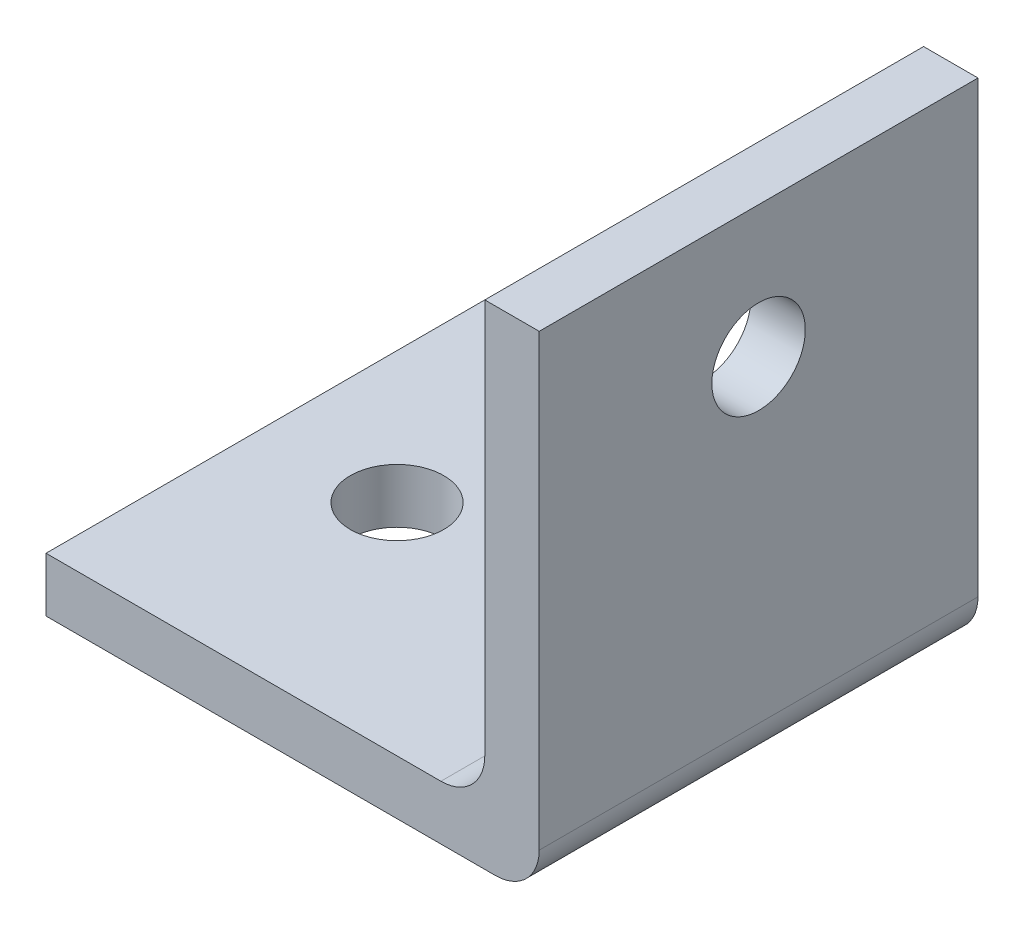
ISO-10303-21;
HEADER;
FILE_DESCRIPTION(('STEP AP214'),'2;1');
FILE_NAME('part.step','',(''),(''),'','','');
FILE_SCHEMA(('AUTOMOTIVE_DESIGN { 1 0 10303 214 1 1 1 1 }'));
ENDSEC;
DATA;
#1=APPLICATION_CONTEXT('core data for automotive mechanical design processes');
#2=APPLICATION_PROTOCOL_DEFINITION('international standard','automotive_design',2000,#1);
#3=PRODUCT_CONTEXT('',#1,'mechanical');
#4=PRODUCT('Part','Part','',(#3));
#5=PRODUCT_RELATED_PRODUCT_CATEGORY('part','',(#4));
#6=PRODUCT_DEFINITION_FORMATION('','',#4);
#7=PRODUCT_DEFINITION_CONTEXT('part definition',#1,'design');
#8=PRODUCT_DEFINITION('design','',#6,#7);
#9=PRODUCT_DEFINITION_SHAPE('','',#8);
#10=(LENGTH_UNIT() NAMED_UNIT(*) SI_UNIT(.MILLI.,.METRE.));
#11=(NAMED_UNIT(*) PLANE_ANGLE_UNIT() SI_UNIT($,.RADIAN.));
#12=(NAMED_UNIT(*) SI_UNIT($,.STERADIAN.) SOLID_ANGLE_UNIT());
#13=UNCERTAINTY_MEASURE_WITH_UNIT(LENGTH_MEASURE(1.E-05),#10,'distance_accuracy_value','');
#14=(GEOMETRIC_REPRESENTATION_CONTEXT(3) GLOBAL_UNCERTAINTY_ASSIGNED_CONTEXT((#13)) GLOBAL_UNIT_ASSIGNED_CONTEXT((#10,
#11,#12)) REPRESENTATION_CONTEXT('',''));
#15=CARTESIAN_POINT('',(0.,0.,0.));
#16=DIRECTION('',(0.,0.,1.));
#17=DIRECTION('',(1.,0.,0.));
#18=AXIS2_PLACEMENT_3D('',#15,#16,#17);
#19=CARTESIAN_POINT('',(0.,0.,12.7));
#20=DIRECTION('',(1.,0.,0.));
#21=DIRECTION('',(0.,0.,-1.));
#22=AXIS2_PLACEMENT_3D('',#19,#20,#21);
#23=PLANE('',#22);
#24=DIRECTION('',(0.,-1.,0.));
#25=VECTOR('',#24,1.);
#26=CARTESIAN_POINT('',(0.,0.,0.));
#27=LINE('',#26,#25);
#28=CARTESIAN_POINT('',(0.,1.5748,0.));
#29=VERTEX_POINT('',#28);
#30=CARTESIAN_POINT('',(0.,0.,0.));
#31=VERTEX_POINT('',#30);
#32=EDGE_CURVE('E117',#29,#31,#27,.T.);
#33=ORIENTED_EDGE('',*,*,#32,.T.);
#34=DIRECTION('',(0.,0.,-1.));
#35=VECTOR('',#34,1.);
#36=CARTESIAN_POINT('',(0.,0.,12.7));
#37=LINE('',#36,#35);
#38=CARTESIAN_POINT('',(0.,0.,12.7));
#39=VERTEX_POINT('',#38);
#40=EDGE_CURVE('E100',#39,#31,#37,.T.);
#41=ORIENTED_EDGE('',*,*,#40,.F.);
#42=DIRECTION('',(0.,-1.,0.));
#43=VECTOR('',#42,1.);
#44=CARTESIAN_POINT('',(0.,0.,12.7));
#45=LINE('',#44,#43);
#46=CARTESIAN_POINT('',(0.,1.5748,12.7));
#47=VERTEX_POINT('',#46);
#48=EDGE_CURVE('E105',#47,#39,#45,.T.);
#49=ORIENTED_EDGE('',*,*,#48,.F.);
#50=DIRECTION('',(0.,0.,-1.));
#51=VECTOR('',#50,1.);
#52=CARTESIAN_POINT('',(0.,1.5748,12.7));
#53=LINE('',#52,#51);
#54=EDGE_CURVE('E158',#47,#29,#53,.T.);
#55=ORIENTED_EDGE('',*,*,#54,.T.);
#56=EDGE_LOOP('',(#33,#41,#49,#55));
#57=FACE_BOUND('',#56,.T.);
#58=ADVANCED_FACE('F34',(#57),#23,.F.);
#59=CARTESIAN_POINT('',(0.,0.,12.7));
#60=DIRECTION('',(0.,1.,0.));
#61=DIRECTION('',(0.,0.,1.));
#62=AXIS2_PLACEMENT_3D('',#59,#60,#61);
#63=PLANE('',#62);
#64=CARTESIAN_POINT('',(3.81,0.,6.35));
#65=DIRECTION('',(0.,1.,0.));
#66=DIRECTION('',(0.,0.,1.));
#67=AXIS2_PLACEMENT_3D('',#64,#65,#66);
#68=CIRCLE('',#67,1.35255);
#69=CARTESIAN_POINT('',(3.81,0.,7.70255));
#70=VERTEX_POINT('',#69);
#71=EDGE_CURVE('E186',#70,#70,#68,.T.);
#72=ORIENTED_EDGE('',*,*,#71,.T.);
#73=EDGE_LOOP('',(#72));
#74=FACE_BOUND('',#73,.T.);
#75=DIRECTION('',(1.,0.,0.));
#76=VECTOR('',#75,1.);
#77=CARTESIAN_POINT('',(0.,0.,0.));
#78=LINE('',#77,#76);
#79=CARTESIAN_POINT('',(13.0048,0.,0.));
#80=VERTEX_POINT('',#79);
#81=EDGE_CURVE('E166',#31,#80,#78,.T.);
#82=ORIENTED_EDGE('',*,*,#81,.T.);
#83=DIRECTION('',(0.,0.,-1.));
#84=VECTOR('',#83,1.);
#85=CARTESIAN_POINT('',(13.0048,0.,12.7));
#86=LINE('',#85,#84);
#87=CARTESIAN_POINT('',(13.0048,0.,12.7));
#88=VERTEX_POINT('',#87);
#89=EDGE_CURVE('E49',#80,#88,#86,.F.);
#90=ORIENTED_EDGE('',*,*,#89,.T.);
#91=DIRECTION('',(1.,0.,0.));
#92=VECTOR('',#91,1.);
#93=CARTESIAN_POINT('',(0.,0.,12.7));
#94=LINE('',#93,#92);
#95=EDGE_CURVE('E96',#39,#88,#94,.T.);
#96=ORIENTED_EDGE('',*,*,#95,.F.);
#97=ORIENTED_EDGE('',*,*,#40,.T.);
#98=EDGE_LOOP('',(#82,#90,#96,#97));
#99=FACE_BOUND('',#98,.T.);
#100=ADVANCED_FACE('F98',(#74,#99),#63,.F.);
#101=CARTESIAN_POINT('',(14.2748,0.,12.7));
#102=DIRECTION('',(-1.,0.,0.));
#103=DIRECTION('',(0.,0.,1.));
#104=AXIS2_PLACEMENT_3D('',#101,#102,#103);
#105=PLANE('',#104);
#106=CARTESIAN_POINT('',(14.2748,10.4648,6.35));
#107=DIRECTION('',(-1.,0.,0.));
#108=DIRECTION('',(0.,0.,1.));
#109=AXIS2_PLACEMENT_3D('',#106,#107,#108);
#110=CIRCLE('',#109,1.35255);
#111=CARTESIAN_POINT('',(14.2748,10.4648,7.70255));
#112=VERTEX_POINT('',#111);
#113=EDGE_CURVE('E167',#112,#112,#110,.T.);
#114=ORIENTED_EDGE('',*,*,#113,.T.);
#115=EDGE_LOOP('',(#114));
#116=FACE_BOUND('',#115,.T.);
#117=DIRECTION('',(0.,1.,0.));
#118=VECTOR('',#117,1.);
#119=CARTESIAN_POINT('',(14.2748,0.,12.7));
#120=LINE('',#119,#118);
#121=CARTESIAN_POINT('',(14.2748,1.27,12.7));
#122=VERTEX_POINT('',#121);
#123=CARTESIAN_POINT('',(14.2748,14.2748,12.7));
#124=VERTEX_POINT('',#123);
#125=EDGE_CURVE('E104',#122,#124,#120,.T.);
#126=ORIENTED_EDGE('',*,*,#125,.F.);
#127=DIRECTION('',(0.,0.,-1.));
#128=VECTOR('',#127,1.);
#129=CARTESIAN_POINT('',(14.2748,1.27,12.7));
#130=LINE('',#129,#128);
#131=CARTESIAN_POINT('',(14.2748,1.27,0.));
#132=VERTEX_POINT('',#131);
#133=EDGE_CURVE('E130',#122,#132,#130,.T.);
#134=ORIENTED_EDGE('',*,*,#133,.T.);
#135=DIRECTION('',(0.,1.,0.));
#136=VECTOR('',#135,1.);
#137=CARTESIAN_POINT('',(14.2748,0.,0.));
#138=LINE('',#137,#136);
#139=CARTESIAN_POINT('',(14.2748,14.2748,0.));
#140=VERTEX_POINT('',#139);
#141=EDGE_CURVE('E169',#132,#140,#138,.T.);
#142=ORIENTED_EDGE('',*,*,#141,.T.);
#143=DIRECTION('',(0.,0.,-1.));
#144=VECTOR('',#143,1.);
#145=CARTESIAN_POINT('',(14.2748,14.2748,12.7));
#146=LINE('',#145,#144);
#147=EDGE_CURVE('E119',#124,#140,#146,.T.);
#148=ORIENTED_EDGE('',*,*,#147,.F.);
#149=EDGE_LOOP('',(#126,#134,#142,#148));
#150=FACE_BOUND('',#149,.T.);
#151=ADVANCED_FACE('F177',(#116,#150),#105,.F.);
#152=CARTESIAN_POINT('',(12.7,14.2748,12.7));
#153=DIRECTION('',(0.,-1.,0.));
#154=DIRECTION('',(0.,0.,-1.));
#155=AXIS2_PLACEMENT_3D('',#152,#153,#154);
#156=PLANE('',#155);
#157=DIRECTION('',(-1.,0.,0.));
#158=VECTOR('',#157,1.);
#159=CARTESIAN_POINT('',(12.7,14.2748,0.));
#160=LINE('',#159,#158);
#161=CARTESIAN_POINT('',(12.7,14.2748,0.));
#162=VERTEX_POINT('',#161);
#163=EDGE_CURVE('E151',#140,#162,#160,.T.);
#164=ORIENTED_EDGE('',*,*,#163,.T.);
#165=DIRECTION('',(0.,0.,-1.));
#166=VECTOR('',#165,1.);
#167=CARTESIAN_POINT('',(12.7,14.2748,12.7));
#168=LINE('',#167,#166);
#169=CARTESIAN_POINT('',(12.7,14.2748,12.7));
#170=VERTEX_POINT('',#169);
#171=EDGE_CURVE('E125',#170,#162,#168,.T.);
#172=ORIENTED_EDGE('',*,*,#171,.F.);
#173=DIRECTION('',(-1.,0.,0.));
#174=VECTOR('',#173,1.);
#175=CARTESIAN_POINT('',(12.7,14.2748,12.7));
#176=LINE('',#175,#174);
#177=EDGE_CURVE('E161',#124,#170,#176,.T.);
#178=ORIENTED_EDGE('',*,*,#177,.F.);
#179=ORIENTED_EDGE('',*,*,#147,.T.);
#180=EDGE_LOOP('',(#164,#172,#178,#179));
#181=FACE_BOUND('',#180,.T.);
#182=ADVANCED_FACE('F202',(#181),#156,.F.);
#183=CARTESIAN_POINT('',(12.7,1.5748,12.7));
#184=DIRECTION('',(1.,0.,0.));
#185=DIRECTION('',(0.,0.,-1.));
#186=AXIS2_PLACEMENT_3D('',#183,#184,#185);
#187=PLANE('',#186);
#188=CARTESIAN_POINT('',(12.7,10.4648,6.35));
#189=DIRECTION('',(-1.,0.,0.));
#190=DIRECTION('',(0.,0.,1.));
#191=AXIS2_PLACEMENT_3D('',#188,#189,#190);
#192=CIRCLE('',#191,1.35254999999999);
#193=CARTESIAN_POINT('',(12.7,10.4648,7.70254999999999));
#194=VERTEX_POINT('',#193);
#195=EDGE_CURVE('E183',#194,#194,#192,.T.);
#196=ORIENTED_EDGE('',*,*,#195,.F.);
#197=EDGE_LOOP('',(#196));
#198=FACE_BOUND('',#197,.T.);
#199=DIRECTION('',(0.,-1.,0.));
#200=VECTOR('',#199,1.);
#201=CARTESIAN_POINT('',(12.7,1.5748,0.));
#202=LINE('',#201,#200);
#203=CARTESIAN_POINT('',(12.7,2.8448,0.));
#204=VERTEX_POINT('',#203);
#205=EDGE_CURVE('E141',#162,#204,#202,.T.);
#206=ORIENTED_EDGE('',*,*,#205,.T.);
#207=DIRECTION('',(0.,0.,-1.));
#208=VECTOR('',#207,1.);
#209=CARTESIAN_POINT('',(12.7,2.8448,12.7));
#210=LINE('',#209,#208);
#211=CARTESIAN_POINT('',(12.7,2.8448,12.7));
#212=VERTEX_POINT('',#211);
#213=EDGE_CURVE('E122',#204,#212,#210,.F.);
#214=ORIENTED_EDGE('',*,*,#213,.T.);
#215=DIRECTION('',(0.,-1.,0.));
#216=VECTOR('',#215,1.);
#217=CARTESIAN_POINT('',(12.7,1.5748,12.7));
#218=LINE('',#217,#216);
#219=EDGE_CURVE('E155',#170,#212,#218,.T.);
#220=ORIENTED_EDGE('',*,*,#219,.F.);
#221=ORIENTED_EDGE('',*,*,#171,.T.);
#222=EDGE_LOOP('',(#206,#214,#220,#221));
#223=FACE_BOUND('',#222,.T.);
#224=ADVANCED_FACE('F147',(#198,#223),#187,.F.);
#225=CARTESIAN_POINT('',(0.,1.5748,12.7));
#226=DIRECTION('',(0.,-1.,0.));
#227=DIRECTION('',(0.,0.,-1.));
#228=AXIS2_PLACEMENT_3D('',#225,#226,#227);
#229=PLANE('',#228);
#230=CARTESIAN_POINT('',(3.81,1.5748,6.35));
#231=DIRECTION('',(0.,1.,0.));
#232=DIRECTION('',(0.,0.,1.));
#233=AXIS2_PLACEMENT_3D('',#230,#231,#232);
#234=CIRCLE('',#233,1.35254999999999);
#235=CARTESIAN_POINT('',(3.81,1.5748,7.70254999999999));
#236=VERTEX_POINT('',#235);
#237=EDGE_CURVE('E189',#236,#236,#234,.T.);
#238=ORIENTED_EDGE('',*,*,#237,.F.);
#239=EDGE_LOOP('',(#238));
#240=FACE_BOUND('',#239,.T.);
#241=DIRECTION('',(-1.,0.,0.));
#242=VECTOR('',#241,1.);
#243=CARTESIAN_POINT('',(0.,1.5748,12.7));
#244=LINE('',#243,#242);
#245=CARTESIAN_POINT('',(11.43,1.5748,12.7));
#246=VERTEX_POINT('',#245);
#247=EDGE_CURVE('E110',#246,#47,#244,.T.);
#248=ORIENTED_EDGE('',*,*,#247,.F.);
#249=DIRECTION('',(0.,0.,-1.));
#250=VECTOR('',#249,1.);
#251=CARTESIAN_POINT('',(11.43,1.5748,0.));
#252=LINE('',#251,#250);
#253=CARTESIAN_POINT('',(11.43,1.5748,0.));
#254=VERTEX_POINT('',#253);
#255=EDGE_CURVE('E118',#246,#254,#252,.T.);
#256=ORIENTED_EDGE('',*,*,#255,.T.);
#257=DIRECTION('',(-1.,0.,0.));
#258=VECTOR('',#257,1.);
#259=CARTESIAN_POINT('',(0.,1.5748,0.));
#260=LINE('',#259,#258);
#261=EDGE_CURVE('E114',#254,#29,#260,.T.);
#262=ORIENTED_EDGE('',*,*,#261,.T.);
#263=ORIENTED_EDGE('',*,*,#54,.F.);
#264=EDGE_LOOP('',(#248,#256,#262,#263));
#265=FACE_BOUND('',#264,.T.);
#266=ADVANCED_FACE('F157',(#240,#265),#229,.F.);
#267=CARTESIAN_POINT('',(0.,0.,12.7));
#268=DIRECTION('',(0.,0.,-1.));
#269=DIRECTION('',(-1.,0.,0.));
#270=AXIS2_PLACEMENT_3D('',#267,#268,#269);
#271=PLANE('',#270);
#272=ORIENTED_EDGE('',*,*,#95,.T.);
#273=CARTESIAN_POINT('',(13.0048,1.27,12.7));
#274=DIRECTION('',(0.,0.,-1.));
#275=DIRECTION('',(-1.,0.,0.));
#276=AXIS2_PLACEMENT_3D('',#273,#274,#275);
#277=CIRCLE('',#276,1.27);
#278=EDGE_CURVE('E135',#88,#122,#277,.F.);
#279=ORIENTED_EDGE('',*,*,#278,.T.);
#280=ORIENTED_EDGE('',*,*,#125,.T.);
#281=ORIENTED_EDGE('',*,*,#177,.T.);
#282=ORIENTED_EDGE('',*,*,#219,.T.);
#283=CARTESIAN_POINT('',(11.43,2.8448,12.7));
#284=DIRECTION('',(0.,0.,-1.));
#285=DIRECTION('',(-1.,0.,0.));
#286=AXIS2_PLACEMENT_3D('',#283,#284,#285);
#287=CIRCLE('',#286,1.27);
#288=EDGE_CURVE('E11',#212,#246,#287,.T.);
#289=ORIENTED_EDGE('',*,*,#288,.T.);
#290=ORIENTED_EDGE('',*,*,#247,.T.);
#291=ORIENTED_EDGE('',*,*,#48,.T.);
#292=EDGE_LOOP('',(#272,#279,#280,#281,#282,#289,#290,#291));
#293=FACE_BOUND('',#292,.T.);
#294=ADVANCED_FACE('F108',(#293),#271,.F.);
#295=CARTESIAN_POINT('',(0.,0.,0.));
#296=DIRECTION('',(0.,0.,-1.));
#297=DIRECTION('',(-1.,0.,0.));
#298=AXIS2_PLACEMENT_3D('',#295,#296,#297);
#299=PLANE('',#298);
#300=ORIENTED_EDGE('',*,*,#141,.F.);
#301=CARTESIAN_POINT('',(13.0048,1.27,0.));
#302=DIRECTION('',(0.,0.,-1.));
#303=DIRECTION('',(-1.,0.,0.));
#304=AXIS2_PLACEMENT_3D('',#301,#302,#303);
#305=CIRCLE('',#304,1.27);
#306=EDGE_CURVE('E57',#132,#80,#305,.T.);
#307=ORIENTED_EDGE('',*,*,#306,.T.);
#308=ORIENTED_EDGE('',*,*,#81,.F.);
#309=ORIENTED_EDGE('',*,*,#32,.F.);
#310=ORIENTED_EDGE('',*,*,#261,.F.);
#311=CARTESIAN_POINT('',(11.43,2.8448,0.));
#312=DIRECTION('',(0.,0.,-1.));
#313=DIRECTION('',(-1.,0.,0.));
#314=AXIS2_PLACEMENT_3D('',#311,#312,#313);
#315=CIRCLE('',#314,1.27);
#316=EDGE_CURVE('E42',#254,#204,#315,.F.);
#317=ORIENTED_EDGE('',*,*,#316,.T.);
#318=ORIENTED_EDGE('',*,*,#205,.F.);
#319=ORIENTED_EDGE('',*,*,#163,.F.);
#320=EDGE_LOOP('',(#300,#307,#308,#309,#310,#317,#318,#319));
#321=FACE_BOUND('',#320,.T.);
#322=ADVANCED_FACE('F139',(#321),#299,.T.);
#323=CARTESIAN_POINT('',(11.43,2.8448,12.7));
#324=DIRECTION('',(0.,0.,1.));
#325=DIRECTION('',(1.,0.,0.));
#326=AXIS2_PLACEMENT_3D('',#323,#324,#325);
#327=CYLINDRICAL_SURFACE('',#326,1.27);
#328=ORIENTED_EDGE('',*,*,#288,.F.);
#329=ORIENTED_EDGE('',*,*,#213,.F.);
#330=ORIENTED_EDGE('',*,*,#316,.F.);
#331=ORIENTED_EDGE('',*,*,#255,.F.);
#332=EDGE_LOOP('',(#328,#329,#330,#331));
#333=FACE_BOUND('',#332,.T.);
#334=ADVANCED_FACE('F154',(#333),#327,.F.);
#335=CARTESIAN_POINT('',(13.0048,1.27,12.7));
#336=DIRECTION('',(0.,0.,-1.));
#337=DIRECTION('',(-1.,0.,0.));
#338=AXIS2_PLACEMENT_3D('',#335,#336,#337);
#339=CYLINDRICAL_SURFACE('',#338,1.27);
#340=ORIENTED_EDGE('',*,*,#278,.F.);
#341=ORIENTED_EDGE('',*,*,#89,.F.);
#342=ORIENTED_EDGE('',*,*,#306,.F.);
#343=ORIENTED_EDGE('',*,*,#133,.F.);
#344=EDGE_LOOP('',(#340,#341,#342,#343));
#345=FACE_BOUND('',#344,.T.);
#346=ADVANCED_FACE('F36',(#345),#339,.T.);
#347=CARTESIAN_POINT('',(12.7,10.4648,6.35));
#348=DIRECTION('',(-1.,0.,0.));
#349=DIRECTION('',(0.,0.,1.));
#350=AXIS2_PLACEMENT_3D('',#347,#348,#349);
#351=CYLINDRICAL_SURFACE('',#350,1.35254999999999);
#352=ORIENTED_EDGE('',*,*,#113,.F.);
#353=EDGE_LOOP('',(#352));
#354=FACE_BOUND('',#353,.T.);
#355=ORIENTED_EDGE('',*,*,#195,.T.);
#356=EDGE_LOOP('',(#355));
#357=FACE_BOUND('',#356,.T.);
#358=ADVANCED_FACE('F219',(#354,#357),#351,.F.);
#359=CARTESIAN_POINT('',(3.81,1.5748,6.35));
#360=DIRECTION('',(0.,1.,0.));
#361=DIRECTION('',(0.,0.,1.));
#362=AXIS2_PLACEMENT_3D('',#359,#360,#361);
#363=CYLINDRICAL_SURFACE('',#362,1.35254999999999);
#364=ORIENTED_EDGE('',*,*,#71,.F.);
#365=EDGE_LOOP('',(#364));
#366=FACE_BOUND('',#365,.T.);
#367=ORIENTED_EDGE('',*,*,#237,.T.);
#368=EDGE_LOOP('',(#367));
#369=FACE_BOUND('',#368,.T.);
#370=ADVANCED_FACE('F193',(#366,#369),#363,.F.);
#371=CLOSED_SHELL('',(#58,#100,#151,#182,#224,#266,#294,#322,#334,#346,#358,#370));
#372=MANIFOLD_SOLID_BREP('B2',#371);
#373=ADVANCED_BREP_SHAPE_REPRESENTATION('',(#18,#372),#14);
#374=SHAPE_DEFINITION_REPRESENTATION(#9,#373);
ENDSEC;
END-ISO-10303-21;
